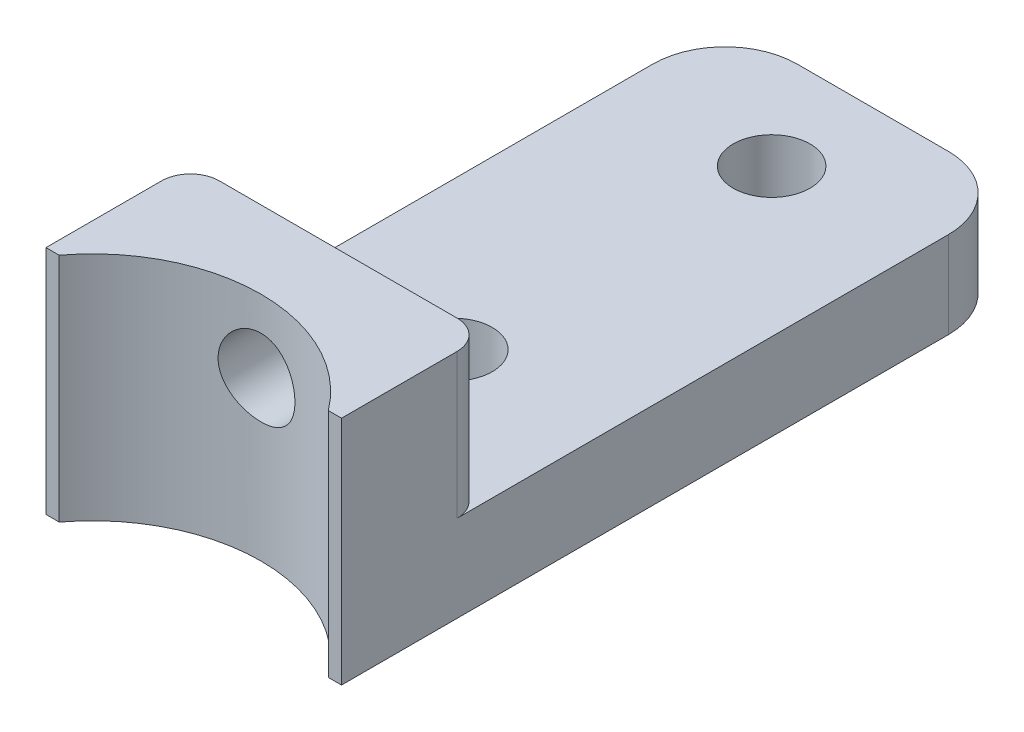
ISO-10303-21;
HEADER;
FILE_DESCRIPTION(('STEP AP214'),'2;1');
FILE_NAME('part.step','',(''),(''),'','','');
FILE_SCHEMA(('AUTOMOTIVE_DESIGN { 1 0 10303 214 1 1 1 1 }'));
ENDSEC;
DATA;
#1=APPLICATION_CONTEXT('core data for automotive mechanical design processes');
#2=APPLICATION_PROTOCOL_DEFINITION('international standard','automotive_design',2000,#1);
#3=PRODUCT_CONTEXT('',#1,'mechanical');
#4=PRODUCT('Part','Part','',(#3));
#5=PRODUCT_RELATED_PRODUCT_CATEGORY('part','',(#4));
#6=PRODUCT_DEFINITION_FORMATION('','',#4);
#7=PRODUCT_DEFINITION_CONTEXT('part definition',#1,'design');
#8=PRODUCT_DEFINITION('design','',#6,#7);
#9=PRODUCT_DEFINITION_SHAPE('','',#8);
#10=(LENGTH_UNIT() NAMED_UNIT(*) SI_UNIT(.MILLI.,.METRE.));
#11=(NAMED_UNIT(*) PLANE_ANGLE_UNIT() SI_UNIT($,.RADIAN.));
#12=(NAMED_UNIT(*) SI_UNIT($,.STERADIAN.) SOLID_ANGLE_UNIT());
#13=UNCERTAINTY_MEASURE_WITH_UNIT(LENGTH_MEASURE(1.E-05),#10,'distance_accuracy_value','');
#14=(GEOMETRIC_REPRESENTATION_CONTEXT(3) GLOBAL_UNCERTAINTY_ASSIGNED_CONTEXT((#13)) GLOBAL_UNIT_ASSIGNED_CONTEXT((#10,
#11,#12)) REPRESENTATION_CONTEXT('',''));
#15=CARTESIAN_POINT('',(0.,0.,0.));
#16=DIRECTION('',(0.,0.,1.));
#17=DIRECTION('',(1.,0.,0.));
#18=AXIS2_PLACEMENT_3D('',#15,#16,#17);
#19=CARTESIAN_POINT('',(0.,7.62,0.));
#20=DIRECTION('',(0.,0.,-1.));
#21=DIRECTION('',(-1.,0.,0.));
#22=AXIS2_PLACEMENT_3D('',#19,#20,#21);
#23=PLANE('',#22);
#24=DIRECTION('',(1.,0.,0.));
#25=VECTOR('',#24,1.);
#26=CARTESIAN_POINT('',(0.,0.,0.));
#27=LINE('',#26,#25);
#28=CARTESIAN_POINT('',(0.,0.,0.));
#29=VERTEX_POINT('',#28);
#30=CARTESIAN_POINT('',(1.16227751075951,0.,0.));
#31=VERTEX_POINT('',#30);
#32=EDGE_CURVE('E145',#29,#31,#27,.T.);
#33=ORIENTED_EDGE('',*,*,#32,.T.);
#34=DIRECTION('',(0.,1.,0.));
#35=VECTOR('',#34,1.);
#36=CARTESIAN_POINT('',(1.16227751075951,-41.8479935241823,0.));
#37=LINE('',#36,#35);
#38=CARTESIAN_POINT('',(1.16227751075951,20.32,0.));
#39=VERTEX_POINT('',#38);
#40=EDGE_CURVE('E130',#31,#39,#37,.T.);
#41=ORIENTED_EDGE('',*,*,#40,.T.);
#42=DIRECTION('',(1.,0.,0.));
#43=VECTOR('',#42,1.);
#44=CARTESIAN_POINT('',(0.,20.32,0.));
#45=LINE('',#44,#43);
#46=CARTESIAN_POINT('',(0.,20.32,0.));
#47=VERTEX_POINT('',#46);
#48=EDGE_CURVE('E143',#47,#39,#45,.T.);
#49=ORIENTED_EDGE('',*,*,#48,.F.);
#50=DIRECTION('',(0.,-1.,0.));
#51=VECTOR('',#50,1.);
#52=CARTESIAN_POINT('',(0.,7.62,0.));
#53=LINE('',#52,#51);
#54=EDGE_CURVE('E182',#47,#29,#53,.T.);
#55=ORIENTED_EDGE('',*,*,#54,.T.);
#56=EDGE_LOOP('',(#33,#41,#49,#55));
#57=FACE_BOUND('',#56,.T.);
#58=ADVANCED_FACE('F39',(#57),#23,.F.);
#59=CARTESIAN_POINT('',(0.,7.62,0.));
#60=DIRECTION('',(0.,-1.,0.));
#61=DIRECTION('',(0.,0.,-1.));
#62=AXIS2_PLACEMENT_3D('',#59,#60,#61);
#63=PLANE('',#62);
#64=CARTESIAN_POINT('',(12.9891418563923,7.62,-50.8));
#65=DIRECTION('',(0.,1.,0.));
#66=DIRECTION('',(0.,0.,1.));
#67=AXIS2_PLACEMENT_3D('',#64,#65,#66);
#68=CIRCLE('',#67,3.37819999999999);
#69=CARTESIAN_POINT('',(12.9891418563923,7.62,-47.4218));
#70=VERTEX_POINT('',#69);
#71=EDGE_CURVE('E315',#70,#70,#68,.T.);
#72=ORIENTED_EDGE('',*,*,#71,.F.);
#73=EDGE_LOOP('',(#72));
#74=FACE_BOUND('',#73,.T.);
#75=CARTESIAN_POINT('',(12.9891418563923,7.62,-22.86));
#76=DIRECTION('',(0.,1.,0.));
#77=DIRECTION('',(0.,0.,1.));
#78=AXIS2_PLACEMENT_3D('',#75,#76,#77);
#79=CIRCLE('',#78,3.37819999999999);
#80=CARTESIAN_POINT('',(12.9891418563923,7.62,-19.4818));
#81=VERTEX_POINT('',#80);
#82=EDGE_CURVE('E322',#81,#81,#79,.T.);
#83=ORIENTED_EDGE('',*,*,#82,.F.);
#84=EDGE_LOOP('',(#83));
#85=FACE_BOUND('',#84,.T.);
#86=DIRECTION('',(0.,0.,-1.));
#87=VECTOR('',#86,1.);
#88=CARTESIAN_POINT('',(25.9782837127846,7.62,0.));
#89=LINE('',#88,#87);
#90=CARTESIAN_POINT('',(25.9782837127846,7.62,-10.16));
#91=VERTEX_POINT('',#90);
#92=CARTESIAN_POINT('',(25.9782837127846,7.62,-53.34));
#93=VERTEX_POINT('',#92);
#94=EDGE_CURVE('E164',#91,#93,#89,.T.);
#95=ORIENTED_EDGE('',*,*,#94,.T.);
#96=CARTESIAN_POINT('',(19.6282837127846,7.62,-53.34));
#97=DIRECTION('',(0.,-1.,0.));
#98=DIRECTION('',(0.,0.,-1.));
#99=AXIS2_PLACEMENT_3D('',#96,#97,#98);
#100=CIRCLE('',#99,6.35);
#101=CARTESIAN_POINT('',(19.6282837127846,7.62,-59.69));
#102=VERTEX_POINT('',#101);
#103=EDGE_CURVE('E197',#93,#102,#100,.F.);
#104=ORIENTED_EDGE('',*,*,#103,.T.);
#105=DIRECTION('',(-1.,0.,0.));
#106=VECTOR('',#105,1.);
#107=CARTESIAN_POINT('',(0.,7.62,-59.69));
#108=LINE('',#107,#106);
#109=CARTESIAN_POINT('',(6.35,7.62,-59.69));
#110=VERTEX_POINT('',#109);
#111=EDGE_CURVE('E168',#102,#110,#108,.T.);
#112=ORIENTED_EDGE('',*,*,#111,.T.);
#113=CARTESIAN_POINT('',(6.35,7.62,-53.34));
#114=DIRECTION('',(0.,-1.,0.));
#115=DIRECTION('',(0.,0.,-1.));
#116=AXIS2_PLACEMENT_3D('',#113,#114,#115);
#117=CIRCLE('',#116,6.35);
#118=CARTESIAN_POINT('',(0.,7.62,-53.34));
#119=VERTEX_POINT('',#118);
#120=EDGE_CURVE('E195',#110,#119,#117,.F.);
#121=ORIENTED_EDGE('',*,*,#120,.T.);
#122=DIRECTION('',(0.,0.,1.));
#123=VECTOR('',#122,1.);
#124=CARTESIAN_POINT('',(0.,7.62,0.));
#125=LINE('',#124,#123);
#126=CARTESIAN_POINT('',(0.,7.62,-10.16));
#127=VERTEX_POINT('',#126);
#128=EDGE_CURVE('E53',#119,#127,#125,.T.);
#129=ORIENTED_EDGE('',*,*,#128,.T.);
#130=CARTESIAN_POINT('',(2.54,7.62,-10.16));
#131=DIRECTION('',(0.,-1.,0.));
#132=DIRECTION('',(0.,0.,-1.));
#133=AXIS2_PLACEMENT_3D('',#130,#131,#132);
#134=CIRCLE('',#133,2.54);
#135=CARTESIAN_POINT('',(2.54,7.62,-12.7));
#136=VERTEX_POINT('',#135);
#137=EDGE_CURVE('E11',#127,#136,#134,.T.);
#138=ORIENTED_EDGE('',*,*,#137,.T.);
#139=DIRECTION('',(-1.,0.,0.));
#140=VECTOR('',#139,1.);
#141=CARTESIAN_POINT('',(0.,7.62,-12.7));
#142=LINE('',#141,#140);
#143=CARTESIAN_POINT('',(23.4382837127846,7.62,-12.7));
#144=VERTEX_POINT('',#143);
#145=EDGE_CURVE('E146',#144,#136,#142,.T.);
#146=ORIENTED_EDGE('',*,*,#145,.F.);
#147=CARTESIAN_POINT('',(23.4382837127846,7.62,-10.16));
#148=DIRECTION('',(0.,-1.,0.));
#149=DIRECTION('',(0.,0.,-1.));
#150=AXIS2_PLACEMENT_3D('',#147,#148,#149);
#151=CIRCLE('',#150,2.54);
#152=EDGE_CURVE('E47',#144,#91,#151,.T.);
#153=ORIENTED_EDGE('',*,*,#152,.T.);
#154=EDGE_LOOP('',(#95,#104,#112,#121,#129,#138,#146,#153));
#155=FACE_BOUND('',#154,.T.);
#156=ADVANCED_FACE('F217',(#74,#85,#155),#63,.F.);
#157=CARTESIAN_POINT('',(0.,7.62,0.));
#158=DIRECTION('',(1.,0.,0.));
#159=DIRECTION('',(0.,0.,-1.));
#160=AXIS2_PLACEMENT_3D('',#157,#158,#159);
#161=PLANE('',#160);
#162=DIRECTION('',(0.,0.,1.));
#163=VECTOR('',#162,1.);
#164=CARTESIAN_POINT('',(0.,20.32,0.));
#165=LINE('',#164,#163);
#166=CARTESIAN_POINT('',(0.,20.32,-10.16));
#167=VERTEX_POINT('',#166);
#168=EDGE_CURVE('E150',#167,#47,#165,.T.);
#169=ORIENTED_EDGE('',*,*,#168,.F.);
#170=DIRECTION('',(0.,-1.,0.));
#171=VECTOR('',#170,1.);
#172=CARTESIAN_POINT('',(0.,7.62,-10.16));
#173=LINE('',#172,#171);
#174=EDGE_CURVE('E212',#167,#127,#173,.T.);
#175=ORIENTED_EDGE('',*,*,#174,.T.);
#176=ORIENTED_EDGE('',*,*,#128,.F.);
#177=DIRECTION('',(0.,-1.,0.));
#178=VECTOR('',#177,1.);
#179=CARTESIAN_POINT('',(0.,7.62,-53.34));
#180=LINE('',#179,#178);
#181=CARTESIAN_POINT('',(0.,0.,-53.34));
#182=VERTEX_POINT('',#181);
#183=EDGE_CURVE('E199',#119,#182,#180,.T.);
#184=ORIENTED_EDGE('',*,*,#183,.T.);
#185=DIRECTION('',(0.,0.,1.));
#186=VECTOR('',#185,1.);
#187=CARTESIAN_POINT('',(0.,0.,0.));
#188=LINE('',#187,#186);
#189=EDGE_CURVE('E160',#182,#29,#188,.T.);
#190=ORIENTED_EDGE('',*,*,#189,.T.);
#191=ORIENTED_EDGE('',*,*,#54,.F.);
#192=EDGE_LOOP('',(#169,#175,#176,#184,#190,#191));
#193=FACE_BOUND('',#192,.T.);
#194=ADVANCED_FACE('F249',(#193),#161,.F.);
#195=CARTESIAN_POINT('',(24.8160062020251,20.32,0.));
#196=VERTEX_POINT('',#195);
#197=CARTESIAN_POINT('',(25.9782837127846,20.32,0.));
#198=VERTEX_POINT('',#197);
#199=EDGE_CURVE('E153',#196,#198,#45,.T.);
#200=ORIENTED_EDGE('',*,*,#199,.F.);
#201=DIRECTION('',(0.,1.,0.));
#202=VECTOR('',#201,1.);
#203=CARTESIAN_POINT('',(24.8160062020251,-41.8479935241823,0.));
#204=LINE('',#203,#202);
#205=CARTESIAN_POINT('',(24.8160062020251,0.,0.));
#206=VERTEX_POINT('',#205);
#207=EDGE_CURVE('E133',#196,#206,#204,.F.);
#208=ORIENTED_EDGE('',*,*,#207,.T.);
#209=CARTESIAN_POINT('',(25.9782837127846,0.,0.));
#210=VERTEX_POINT('',#209);
#211=EDGE_CURVE('E173',#206,#210,#27,.T.);
#212=ORIENTED_EDGE('',*,*,#211,.T.);
#213=DIRECTION('',(0.,-1.,0.));
#214=VECTOR('',#213,1.);
#215=CARTESIAN_POINT('',(25.9782837127846,7.62,0.));
#216=LINE('',#215,#214);
#217=EDGE_CURVE('E171',#198,#210,#216,.T.);
#218=ORIENTED_EDGE('',*,*,#217,.F.);
#219=EDGE_LOOP('',(#200,#208,#212,#218));
#220=FACE_BOUND('',#219,.T.);
#221=ADVANCED_FACE('F229',(#220),#23,.F.);
#222=CARTESIAN_POINT('',(25.9782837127846,7.62,0.));
#223=DIRECTION('',(-1.,0.,0.));
#224=DIRECTION('',(0.,0.,1.));
#225=AXIS2_PLACEMENT_3D('',#222,#223,#224);
#226=PLANE('',#225);
#227=ORIENTED_EDGE('',*,*,#94,.F.);
#228=DIRECTION('',(0.,-1.,0.));
#229=VECTOR('',#228,1.);
#230=CARTESIAN_POINT('',(25.9782837127846,7.62,-10.16));
#231=LINE('',#230,#229);
#232=CARTESIAN_POINT('',(25.9782837127846,20.32,-10.16));
#233=VERTEX_POINT('',#232);
#234=EDGE_CURVE('E207',#91,#233,#231,.F.);
#235=ORIENTED_EDGE('',*,*,#234,.T.);
#236=DIRECTION('',(0.,0.,-1.));
#237=VECTOR('',#236,1.);
#238=CARTESIAN_POINT('',(25.9782837127846,20.32,0.));
#239=LINE('',#238,#237);
#240=EDGE_CURVE('E152',#198,#233,#239,.T.);
#241=ORIENTED_EDGE('',*,*,#240,.F.);
#242=ORIENTED_EDGE('',*,*,#217,.T.);
#243=DIRECTION('',(0.,0.,-1.));
#244=VECTOR('',#243,1.);
#245=CARTESIAN_POINT('',(25.9782837127846,0.,0.));
#246=LINE('',#245,#244);
#247=CARTESIAN_POINT('',(25.9782837127846,0.,-53.34));
#248=VERTEX_POINT('',#247);
#249=EDGE_CURVE('E175',#210,#248,#246,.T.);
#250=ORIENTED_EDGE('',*,*,#249,.T.);
#251=DIRECTION('',(0.,-1.,0.));
#252=VECTOR('',#251,1.);
#253=CARTESIAN_POINT('',(25.9782837127846,7.62,-53.34));
#254=LINE('',#253,#252);
#255=EDGE_CURVE('E193',#248,#93,#254,.F.);
#256=ORIENTED_EDGE('',*,*,#255,.T.);
#257=EDGE_LOOP('',(#227,#235,#241,#242,#250,#256));
#258=FACE_BOUND('',#257,.T.);
#259=ADVANCED_FACE('F225',(#258),#226,.F.);
#260=CARTESIAN_POINT('',(0.,7.62,-59.69));
#261=DIRECTION('',(0.,0.,1.));
#262=DIRECTION('',(1.,0.,0.));
#263=AXIS2_PLACEMENT_3D('',#260,#261,#262);
#264=PLANE('',#263);
#265=ORIENTED_EDGE('',*,*,#111,.F.);
#266=DIRECTION('',(0.,-1.,0.));
#267=VECTOR('',#266,1.);
#268=CARTESIAN_POINT('',(19.6282837127846,7.62,-59.69));
#269=LINE('',#268,#267);
#270=CARTESIAN_POINT('',(19.6282837127846,0.,-59.69));
#271=VERTEX_POINT('',#270);
#272=EDGE_CURVE('E186',#102,#271,#269,.T.);
#273=ORIENTED_EDGE('',*,*,#272,.T.);
#274=DIRECTION('',(-1.,0.,0.));
#275=VECTOR('',#274,1.);
#276=CARTESIAN_POINT('',(0.,0.,-59.69));
#277=LINE('',#276,#275);
#278=CARTESIAN_POINT('',(6.35,0.,-59.69));
#279=VERTEX_POINT('',#278);
#280=EDGE_CURVE('E165',#271,#279,#277,.T.);
#281=ORIENTED_EDGE('',*,*,#280,.T.);
#282=DIRECTION('',(0.,-1.,0.));
#283=VECTOR('',#282,1.);
#284=CARTESIAN_POINT('',(6.35,7.62,-59.69));
#285=LINE('',#284,#283);
#286=EDGE_CURVE('E184',#279,#110,#285,.F.);
#287=ORIENTED_EDGE('',*,*,#286,.T.);
#288=EDGE_LOOP('',(#265,#273,#281,#287));
#289=FACE_BOUND('',#288,.T.);
#290=ADVANCED_FACE('F241',(#289),#264,.F.);
#291=CARTESIAN_POINT('',(0.,0.,0.));
#292=DIRECTION('',(0.,-1.,0.));
#293=DIRECTION('',(0.,0.,-1.));
#294=AXIS2_PLACEMENT_3D('',#291,#292,#293);
#295=PLANE('',#294);
#296=CARTESIAN_POINT('',(12.9891418563923,0.,-50.8));
#297=DIRECTION('',(0.,-1.,0.));
#298=DIRECTION('',(0.,0.,-1.));
#299=AXIS2_PLACEMENT_3D('',#296,#297,#298);
#300=CIRCLE('',#299,3.37819999999999);
#301=CARTESIAN_POINT('',(12.9891418563923,0.,-54.1782));
#302=VERTEX_POINT('',#301);
#303=EDGE_CURVE('E319',#302,#302,#300,.T.);
#304=ORIENTED_EDGE('',*,*,#303,.F.);
#305=EDGE_LOOP('',(#304));
#306=FACE_BOUND('',#305,.T.);
#307=CARTESIAN_POINT('',(12.9891418563923,0.,-22.86));
#308=DIRECTION('',(0.,-1.,0.));
#309=DIRECTION('',(0.,0.,-1.));
#310=AXIS2_PLACEMENT_3D('',#307,#308,#309);
#311=CIRCLE('',#310,3.37819999999999);
#312=CARTESIAN_POINT('',(12.9891418563923,0.,-26.2382));
#313=VERTEX_POINT('',#312);
#314=EDGE_CURVE('E137',#313,#313,#311,.T.);
#315=ORIENTED_EDGE('',*,*,#314,.F.);
#316=EDGE_LOOP('',(#315));
#317=FACE_BOUND('',#316,.T.);
#318=ORIENTED_EDGE('',*,*,#280,.F.);
#319=CARTESIAN_POINT('',(19.6282837127846,0.,-53.34));
#320=DIRECTION('',(0.,-1.,0.));
#321=DIRECTION('',(0.,0.,-1.));
#322=AXIS2_PLACEMENT_3D('',#319,#320,#321);
#323=CIRCLE('',#322,6.35);
#324=EDGE_CURVE('E191',#271,#248,#323,.T.);
#325=ORIENTED_EDGE('',*,*,#324,.T.);
#326=ORIENTED_EDGE('',*,*,#249,.F.);
#327=ORIENTED_EDGE('',*,*,#211,.F.);
#328=CARTESIAN_POINT('',(12.9891418563923,0.,8.89));
#329=DIRECTION('',(0.,-1.,0.));
#330=DIRECTION('',(0.,0.,-1.));
#331=AXIS2_PLACEMENT_3D('',#328,#329,#330);
#332=CIRCLE('',#331,14.7955);
#333=EDGE_CURVE('E136',#206,#31,#332,.F.);
#334=ORIENTED_EDGE('',*,*,#333,.T.);
#335=ORIENTED_EDGE('',*,*,#32,.F.);
#336=ORIENTED_EDGE('',*,*,#189,.F.);
#337=CARTESIAN_POINT('',(6.35,0.,-53.34));
#338=DIRECTION('',(0.,-1.,0.));
#339=DIRECTION('',(0.,0.,-1.));
#340=AXIS2_PLACEMENT_3D('',#337,#338,#339);
#341=CIRCLE('',#340,6.35);
#342=EDGE_CURVE('E189',#182,#279,#341,.T.);
#343=ORIENTED_EDGE('',*,*,#342,.T.);
#344=EDGE_LOOP('',(#318,#325,#326,#327,#334,#335,#336,#343));
#345=FACE_BOUND('',#344,.T.);
#346=ADVANCED_FACE('F235',(#306,#317,#345),#295,.T.);
#347=CARTESIAN_POINT('',(0.,20.32,-12.7));
#348=DIRECTION('',(0.,0.,1.));
#349=DIRECTION('',(1.,0.,0.));
#350=AXIS2_PLACEMENT_3D('',#347,#348,#349);
#351=PLANE('',#350);
#352=CARTESIAN_POINT('',(12.9891418563923,13.97,-12.7));
#353=DIRECTION('',(0.,0.,-1.));
#354=DIRECTION('',(-1.,0.,0.));
#355=AXIS2_PLACEMENT_3D('',#352,#353,#354);
#356=CIRCLE('',#355,3.37819999999999);
#357=CARTESIAN_POINT('',(9.61094185639231,13.97,-12.7));
#358=VERTEX_POINT('',#357);
#359=EDGE_CURVE('E316',#358,#358,#356,.T.);
#360=ORIENTED_EDGE('',*,*,#359,.F.);
#361=EDGE_LOOP('',(#360));
#362=FACE_BOUND('',#361,.T.);
#363=DIRECTION('',(-1.,0.,0.));
#364=VECTOR('',#363,1.);
#365=CARTESIAN_POINT('',(0.,20.32,-12.7));
#366=LINE('',#365,#364);
#367=CARTESIAN_POINT('',(23.4382837127846,20.32,-12.7));
#368=VERTEX_POINT('',#367);
#369=CARTESIAN_POINT('',(2.54,20.32,-12.7));
#370=VERTEX_POINT('',#369);
#371=EDGE_CURVE('E155',#368,#370,#366,.T.);
#372=ORIENTED_EDGE('',*,*,#371,.F.);
#373=DIRECTION('',(0.,-1.,0.));
#374=VECTOR('',#373,1.);
#375=CARTESIAN_POINT('',(23.4382837127846,20.32,-12.7));
#376=LINE('',#375,#374);
#377=EDGE_CURVE('E204',#368,#144,#376,.T.);
#378=ORIENTED_EDGE('',*,*,#377,.T.);
#379=ORIENTED_EDGE('',*,*,#145,.T.);
#380=DIRECTION('',(0.,-1.,0.));
#381=VECTOR('',#380,1.);
#382=CARTESIAN_POINT('',(2.54,20.32,-12.7));
#383=LINE('',#382,#381);
#384=EDGE_CURVE('E202',#136,#370,#383,.F.);
#385=ORIENTED_EDGE('',*,*,#384,.T.);
#386=EDGE_LOOP('',(#372,#378,#379,#385));
#387=FACE_BOUND('',#386,.T.);
#388=ADVANCED_FACE('F254',(#362,#387),#351,.F.);
#389=CARTESIAN_POINT('',(0.,20.32,0.));
#390=DIRECTION('',(0.,-1.,0.));
#391=DIRECTION('',(0.,0.,-1.));
#392=AXIS2_PLACEMENT_3D('',#389,#390,#391);
#393=PLANE('',#392);
#394=ORIENTED_EDGE('',*,*,#240,.T.);
#395=CARTESIAN_POINT('',(23.4382837127846,20.32,-10.16));
#396=DIRECTION('',(0.,-1.,0.));
#397=DIRECTION('',(0.,0.,-1.));
#398=AXIS2_PLACEMENT_3D('',#395,#396,#397);
#399=CIRCLE('',#398,2.54);
#400=EDGE_CURVE('E210',#233,#368,#399,.F.);
#401=ORIENTED_EDGE('',*,*,#400,.T.);
#402=ORIENTED_EDGE('',*,*,#371,.T.);
#403=CARTESIAN_POINT('',(2.54,20.32,-10.16));
#404=DIRECTION('',(0.,-1.,0.));
#405=DIRECTION('',(0.,0.,-1.));
#406=AXIS2_PLACEMENT_3D('',#403,#404,#405);
#407=CIRCLE('',#406,2.54);
#408=EDGE_CURVE('E61',#370,#167,#407,.F.);
#409=ORIENTED_EDGE('',*,*,#408,.T.);
#410=ORIENTED_EDGE('',*,*,#168,.T.);
#411=ORIENTED_EDGE('',*,*,#48,.T.);
#412=CARTESIAN_POINT('',(12.9891418563923,20.32,8.89));
#413=DIRECTION('',(0.,1.,0.));
#414=DIRECTION('',(0.,0.,1.));
#415=AXIS2_PLACEMENT_3D('',#412,#413,#414);
#416=CIRCLE('',#415,14.7955);
#417=EDGE_CURVE('E127',#196,#39,#416,.T.);
#418=ORIENTED_EDGE('',*,*,#417,.F.);
#419=ORIENTED_EDGE('',*,*,#199,.T.);
#420=EDGE_LOOP('',(#394,#401,#402,#409,#410,#411,#418,#419));
#421=FACE_BOUND('',#420,.T.);
#422=ADVANCED_FACE('F149',(#421),#393,.F.);
#423=CARTESIAN_POINT('',(12.9891418563923,-41.8479935241823,8.89));
#424=DIRECTION('',(0.,1.,0.));
#425=DIRECTION('',(0.,0.,1.));
#426=AXIS2_PLACEMENT_3D('',#423,#424,#425);
#427=CYLINDRICAL_SURFACE('',#426,14.7955);
#428=CARTESIAN_POINT('',(9.6109418563923,13.97,-5.51467233261486));
#429=CARTESIAN_POINT('',(9.61094799321868,14.1570817956664,-5.51467609659));
#430=CARTESIAN_POINT('',(9.62653538365263,14.3442355419409,-5.51835667107215));
#431=CARTESIAN_POINT('',(9.68839582213402,14.7132054552618,-5.53265119056226));
#432=CARTESIAN_POINT('',(9.73468977383888,14.8950178980772,-5.54326985864129));
#433=CARTESIAN_POINT('',(9.85641704656213,15.2479147740078,-5.5701766718939));
#434=CARTESIAN_POINT('',(9.93181674997189,15.4190113201415,-5.5864582741484));
#435=CARTESIAN_POINT('',(10.10951701947,15.7461346192283,-5.62284848499042));
#436=CARTESIAN_POINT('',(10.2118175381712,15.9021613987269,-5.64295708683648));
#437=CARTESIAN_POINT('',(10.4424220663744,16.1975867486806,-5.68514896319157));
#438=CARTESIAN_POINT('',(10.5711281217573,16.3366676670036,-5.70725939386127));
#439=CARTESIAN_POINT('',(10.8500228427162,16.5914664605914,-5.75072655113757));
#440=CARTESIAN_POINT('',(11.0002132711789,16.7071824167782,-5.7720832157149));
#441=CARTESIAN_POINT('',(11.3199569265576,16.913235790692,-5.81193369214267));
#442=CARTESIAN_POINT('',(11.4897131357219,17.0032657472589,-5.83039172033976));
#443=CARTESIAN_POINT('',(11.8424385120061,17.1533994405424,-5.86205755204651));
#444=CARTESIAN_POINT('',(12.0254060576179,17.2135068427125,-5.87526599857953));
#445=CARTESIAN_POINT('',(12.3960546743597,17.301084693223,-5.89475250880508));
#446=CARTESIAN_POINT('',(12.5836024793173,17.3290933220038,-5.90114472499065));
#447=CARTESIAN_POINT('',(12.9608364877198,17.3533631812927,-5.9066747239228));
#448=CARTESIAN_POINT('',(13.1505224225948,17.3496283556695,-5.9058134078625));
#449=CARTESIAN_POINT('',(13.5229315683198,17.3109141199001,-5.8970199668198));
#450=CARTESIAN_POINT('',(13.7057186675499,17.2765150299748,-5.8892191767964));
#451=CARTESIAN_POINT('',(14.0628549472157,17.1783758384457,-5.86757386295098));
#452=CARTESIAN_POINT('',(14.2372037240266,17.1146343348547,-5.85372905034582));
#453=CARTESIAN_POINT('',(14.5741010087658,16.959119412369,-5.82134309536564));
#454=CARTESIAN_POINT('',(14.7365462118851,16.8671300030802,-5.80276596186401));
#455=CARTESIAN_POINT('',(15.043903526754,16.6578923312578,-5.76294606782882));
#456=CARTESIAN_POINT('',(15.1888130467993,16.5406403421183,-5.74170291421091));
#457=CARTESIAN_POINT('',(15.4604403220662,16.2810602740158,-5.6983130745874));
#458=CARTESIAN_POINT('',(15.5866717556631,16.1382244253789,-5.67615682163789));
#459=CARTESIAN_POINT('',(15.8134857253479,15.8331805160069,-5.63388556159804));
#460=CARTESIAN_POINT('',(15.9140674338962,15.6709718304922,-5.61377062037933));
#461=CARTESIAN_POINT('',(16.0869702270698,15.3309517837102,-5.57783127247445));
#462=CARTESIAN_POINT('',(16.1591920946475,15.1530882634986,-5.56202198720924));
#463=CARTESIAN_POINT('',(16.2725700807765,14.7873008729932,-5.536688108954));
#464=CARTESIAN_POINT('',(16.3137316205426,14.5993787644424,-5.52716241927282));
#465=CARTESIAN_POINT('',(16.3630509284048,14.2232719132231,-5.51569993656914));
#466=CARTESIAN_POINT('',(16.3719200221528,14.0351853208605,-5.51359961109061));
#467=CARTESIAN_POINT('',(16.3583348737421,13.6602209277959,-5.51678334614533));
#468=CARTESIAN_POINT('',(16.3358829934307,13.4733430370158,-5.52206684987999));
#469=CARTESIAN_POINT('',(16.260912397795,13.1086253341725,-5.53926781339631));
#470=CARTESIAN_POINT('',(16.2087919611678,12.9306991191166,-5.55109734010221));
#471=CARTESIAN_POINT('',(16.0763980013016,12.5861057753338,-5.57997691519242));
#472=CARTESIAN_POINT('',(15.9961215877978,12.4194398045882,-5.59702749950545));
#473=CARTESIAN_POINT('',(15.8081504536351,12.0990385442874,-5.634782894962));
#474=CARTESIAN_POINT('',(15.700021326283,11.9455648634072,-5.65554384042518));
#475=CARTESIAN_POINT('',(15.4599768712693,11.658679612954,-5.69823579764244));
#476=CARTESIAN_POINT('',(15.3280583110287,11.5252707743754,-5.72016696812466));
#477=CARTESIAN_POINT('',(15.0409471844885,11.2795060036736,-5.76327182850195));
#478=CARTESIAN_POINT('',(14.8853333161518,11.1676371626748,-5.78442080835095));
#479=CARTESIAN_POINT('',(14.557110369339,10.9716269664057,-5.82310846337319));
#480=CARTESIAN_POINT('',(14.3845021200717,10.8874842591609,-5.84064731456691));
#481=CARTESIAN_POINT('',(14.0283102383907,10.7499755400365,-5.87003516547202));
#482=CARTESIAN_POINT('',(13.8448087133011,10.696405265025,-5.8819218377279));
#483=CARTESIAN_POINT('',(13.4711063624357,10.620930369255,-5.89882956258795));
#484=CARTESIAN_POINT('',(13.2809066079397,10.599020708212,-5.90385170799944));
#485=CARTESIAN_POINT('',(12.9038162119372,10.5877325051625,-5.90642848435336));
#486=CARTESIAN_POINT('',(12.7169480376508,10.5976293142003,-5.90414946206809));
#487=CARTESIAN_POINT('',(12.3476132863722,10.6480408196861,-5.89274003627742));
#488=CARTESIAN_POINT('',(12.1651466161237,10.6885548668464,-5.88360977806348));
#489=CARTESIAN_POINT('',(11.8104135925792,10.7986906850517,-5.85954011813609));
#490=CARTESIAN_POINT('',(11.6381111144101,10.8682012667715,-5.84462292199997));
#491=CARTESIAN_POINT('',(11.3075225683085,11.0342516520688,-5.8105654553659));
#492=CARTESIAN_POINT('',(11.1492379911853,11.1307943259868,-5.79142473644866));
#493=CARTESIAN_POINT('',(10.8476716039265,11.3504864657098,-5.75051162234058));
#494=CARTESIAN_POINT('',(10.7047635206372,11.4741404308781,-5.72869335166993));
#495=CARTESIAN_POINT('',(10.4414787913221,11.7435384382353,-5.68511861117274));
#496=CARTESIAN_POINT('',(10.3211076540626,11.8892878655629,-5.66336215773286));
#497=CARTESIAN_POINT('',(10.1045792773964,12.2013462321941,-5.62201163359274));
#498=CARTESIAN_POINT('',(10.008808518525,12.3679285492233,-5.60245450840986));
#499=CARTESIAN_POINT('',(9.84677484419645,12.7152407831059,-5.56819006701272));
#500=CARTESIAN_POINT('',(9.78048796017909,12.8959590672303,-5.55347881393877));
#501=CARTESIAN_POINT('',(9.69057000117513,13.2256045090975,-5.5331704622578));
#502=CARTESIAN_POINT('',(9.66076891825093,13.3728000422175,-5.52628144646737));
#503=CARTESIAN_POINT('',(9.6209529588877,13.669981733665,-5.51703100365992));
#504=CARTESIAN_POINT('',(9.61093693489799,13.8199677296338,-5.51466931405428));
#505=CARTESIAN_POINT('',(9.6109418563923,13.97,-5.51467233261486));
#506=B_SPLINE_CURVE_WITH_KNOTS('',3,(#428,#429,#430,#431,#432,#433,#434,#435,#436,#437,#438,
#439,#440,#441,#442,#443,#444,#445,#446,#447,#448,#449,#450,#451,#452,#453,#454,#455,#456,#457,
#458,#459,#460,#461,#462,#463,#464,#465,#466,#467,#468,#469,#470,#471,#472,#473,#474,#475,#476,
#477,#478,#479,#480,#481,#482,#483,#484,#485,#486,#487,#488,#489,#490,#491,#492,#493,#494,#495,
#496,#497,#498,#499,#500,#501,#502,#503,#504,#505),.UNSPECIFIED.,.T.,.F.,(4,2,2,2,2,2,2,2,2,2,2,
2,2,2,2,2,2,2,2,2,2,2,2,2,2,2,2,2,2,2,2,2,2,2,2,2,2,2,4),(0.,0.560695221763596,1.12177253210967,
1.68220371893426,2.24263391853869,2.81233201475853,3.38207688404032,3.9583800068397,
4.534612516268,5.10103544953461,5.66738801034047,6.22324469250075,6.77912793637656,
7.33937214449893,7.89969905362165,8.47271592560195,9.04575128254065,9.62077391630715,
10.1956961634098,10.7578749050255,11.3200112562444,11.8747735322849,12.4295927724085,
12.9936530333483,13.5577899983106,14.1334798900307,14.7091417059559,15.2809109255578,
15.8525891110063,16.4113358373591,16.9700707149258,17.5266824958497,18.0833534017417,
18.6514270215084,19.2196393162682,19.7962969162553,20.372484868763,20.8221665515937,
21.2718221517285),.UNSPECIFIED.);
#507=CARTESIAN_POINT('',(9.6109418563923,13.97,-5.51467233261486));
#508=VERTEX_POINT('',#507);
#509=EDGE_CURVE('E308',#508,#508,#506,.T.);
#510=ORIENTED_EDGE('',*,*,#509,.T.);
#511=EDGE_LOOP('',(#510));
#512=FACE_BOUND('',#511,.T.);
#513=ORIENTED_EDGE('',*,*,#333,.F.);
#514=ORIENTED_EDGE('',*,*,#207,.F.);
#515=ORIENTED_EDGE('',*,*,#417,.T.);
#516=ORIENTED_EDGE('',*,*,#40,.F.);
#517=EDGE_LOOP('',(#513,#514,#515,#516));
#518=FACE_BOUND('',#517,.T.);
#519=ADVANCED_FACE('F129',(#512,#518),#427,.F.);
#520=CARTESIAN_POINT('',(12.9891418563923,7.62,-22.86));
#521=DIRECTION('',(0.,1.,0.));
#522=DIRECTION('',(0.,0.,1.));
#523=AXIS2_PLACEMENT_3D('',#520,#521,#522);
#524=CYLINDRICAL_SURFACE('',#523,3.37819999999999);
#525=ORIENTED_EDGE('',*,*,#82,.T.);
#526=EDGE_LOOP('',(#525));
#527=FACE_BOUND('',#526,.T.);
#528=ORIENTED_EDGE('',*,*,#314,.T.);
#529=EDGE_LOOP('',(#528));
#530=FACE_BOUND('',#529,.T.);
#531=ADVANCED_FACE('F330',(#527,#530),#524,.F.);
#532=CARTESIAN_POINT('',(12.9891418563923,7.62,-50.8));
#533=DIRECTION('',(0.,1.,0.));
#534=DIRECTION('',(0.,0.,1.));
#535=AXIS2_PLACEMENT_3D('',#532,#533,#534);
#536=CYLINDRICAL_SURFACE('',#535,3.37819999999999);
#537=ORIENTED_EDGE('',*,*,#71,.T.);
#538=EDGE_LOOP('',(#537));
#539=FACE_BOUND('',#538,.T.);
#540=ORIENTED_EDGE('',*,*,#303,.T.);
#541=EDGE_LOOP('',(#540));
#542=FACE_BOUND('',#541,.T.);
#543=ADVANCED_FACE('F288',(#539,#542),#536,.F.);
#544=CARTESIAN_POINT('',(19.6282837127846,7.62,-53.34));
#545=DIRECTION('',(0.,-1.,0.));
#546=DIRECTION('',(0.,0.,-1.));
#547=AXIS2_PLACEMENT_3D('',#544,#545,#546);
#548=CYLINDRICAL_SURFACE('',#547,6.35);
#549=ORIENTED_EDGE('',*,*,#103,.F.);
#550=ORIENTED_EDGE('',*,*,#255,.F.);
#551=ORIENTED_EDGE('',*,*,#324,.F.);
#552=ORIENTED_EDGE('',*,*,#272,.F.);
#553=EDGE_LOOP('',(#549,#550,#551,#552));
#554=FACE_BOUND('',#553,.T.);
#555=ADVANCED_FACE('F238',(#554),#548,.T.);
#556=CARTESIAN_POINT('',(6.35,7.62,-53.34));
#557=DIRECTION('',(0.,-1.,0.));
#558=DIRECTION('',(0.,0.,-1.));
#559=AXIS2_PLACEMENT_3D('',#556,#557,#558);
#560=CYLINDRICAL_SURFACE('',#559,6.35);
#561=ORIENTED_EDGE('',*,*,#120,.F.);
#562=ORIENTED_EDGE('',*,*,#286,.F.);
#563=ORIENTED_EDGE('',*,*,#342,.F.);
#564=ORIENTED_EDGE('',*,*,#183,.F.);
#565=EDGE_LOOP('',(#561,#562,#563,#564));
#566=FACE_BOUND('',#565,.T.);
#567=ADVANCED_FACE('F246',(#566),#560,.T.);
#568=CARTESIAN_POINT('',(23.4382837127846,20.32,-10.16));
#569=DIRECTION('',(0.,-1.,0.));
#570=DIRECTION('',(0.,0.,-1.));
#571=AXIS2_PLACEMENT_3D('',#568,#569,#570);
#572=CYLINDRICAL_SURFACE('',#571,2.54);
#573=ORIENTED_EDGE('',*,*,#400,.F.);
#574=ORIENTED_EDGE('',*,*,#234,.F.);
#575=ORIENTED_EDGE('',*,*,#152,.F.);
#576=ORIENTED_EDGE('',*,*,#377,.F.);
#577=EDGE_LOOP('',(#573,#574,#575,#576));
#578=FACE_BOUND('',#577,.T.);
#579=ADVANCED_FACE('F222',(#578),#572,.T.);
#580=CARTESIAN_POINT('',(2.54,7.62,-10.16));
#581=DIRECTION('',(0.,-1.,0.));
#582=DIRECTION('',(0.,0.,-1.));
#583=AXIS2_PLACEMENT_3D('',#580,#581,#582);
#584=CYLINDRICAL_SURFACE('',#583,2.54);
#585=ORIENTED_EDGE('',*,*,#408,.F.);
#586=ORIENTED_EDGE('',*,*,#384,.F.);
#587=ORIENTED_EDGE('',*,*,#137,.F.);
#588=ORIENTED_EDGE('',*,*,#174,.F.);
#589=EDGE_LOOP('',(#585,#586,#587,#588));
#590=FACE_BOUND('',#589,.T.);
#591=ADVANCED_FACE('F41',(#590),#584,.T.);
#592=CARTESIAN_POINT('',(12.9891418563923,13.97,-12.7));
#593=DIRECTION('',(0.,0.,-1.));
#594=DIRECTION('',(-1.,0.,0.));
#595=AXIS2_PLACEMENT_3D('',#592,#593,#594);
#596=CYLINDRICAL_SURFACE('',#595,3.37819999999999);
#597=ORIENTED_EDGE('',*,*,#509,.F.);
#598=EDGE_LOOP('',(#597));
#599=FACE_BOUND('',#598,.T.);
#600=ORIENTED_EDGE('',*,*,#359,.T.);
#601=EDGE_LOOP('',(#600));
#602=FACE_BOUND('',#601,.T.);
#603=ADVANCED_FACE('F293',(#599,#602),#596,.F.);
#604=CLOSED_SHELL('',(#58,#156,#194,#221,#259,#290,#346,#388,#422,#519,#531,#543,#555,#567,#579,
#591,#603));
#605=MANIFOLD_SOLID_BREP('B2',#604);
#606=ADVANCED_BREP_SHAPE_REPRESENTATION('',(#18,#605),#14);
#607=SHAPE_DEFINITION_REPRESENTATION(#9,#606);
ENDSEC;
END-ISO-10303-21;
